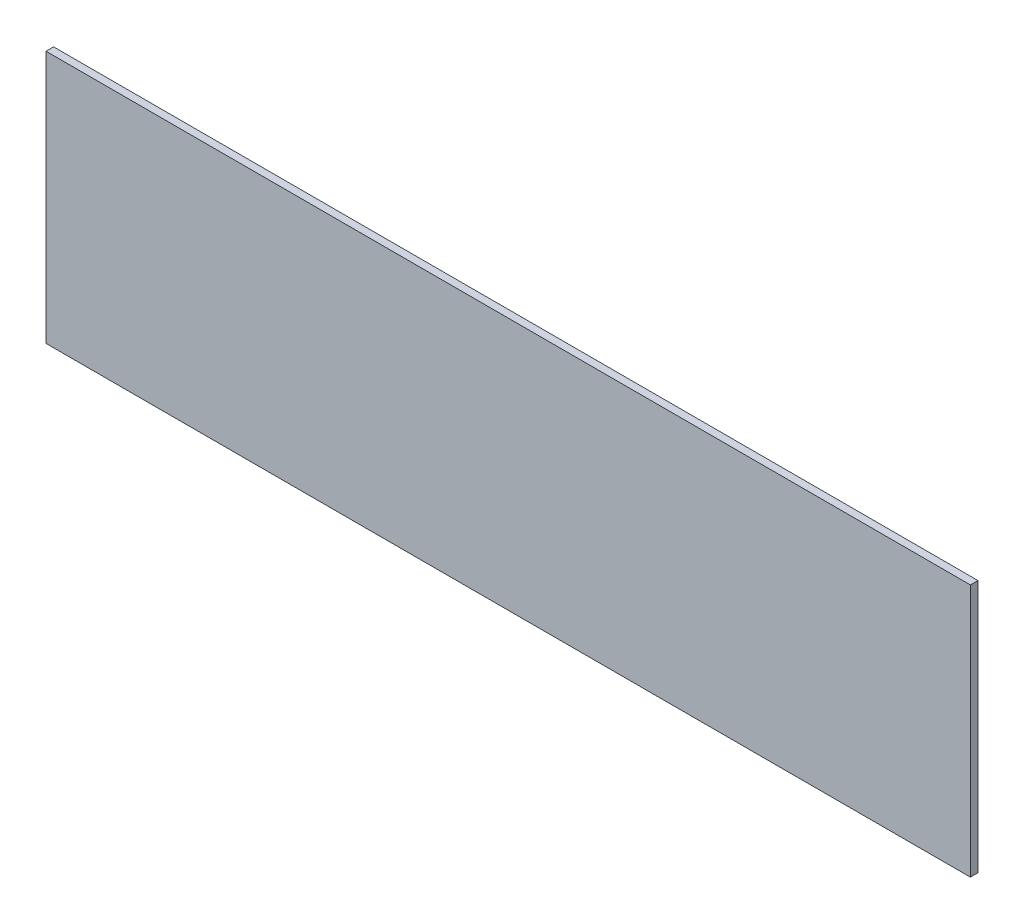
ISO-10303-21;
HEADER;
FILE_DESCRIPTION(('STEP AP214'),'2;1');
FILE_NAME('part.step','',(''),(''),'','','');
FILE_SCHEMA(('AUTOMOTIVE_DESIGN { 1 0 10303 214 1 1 1 1 }'));
ENDSEC;
DATA;
#1=APPLICATION_CONTEXT('core data for automotive mechanical design processes');
#2=APPLICATION_PROTOCOL_DEFINITION('international standard','automotive_design',2000,#1);
#3=PRODUCT_CONTEXT('',#1,'mechanical');
#4=PRODUCT('Part','Part','',(#3));
#5=PRODUCT_RELATED_PRODUCT_CATEGORY('part','',(#4));
#6=PRODUCT_DEFINITION_FORMATION('','',#4);
#7=PRODUCT_DEFINITION_CONTEXT('part definition',#1,'design');
#8=PRODUCT_DEFINITION('design','',#6,#7);
#9=PRODUCT_DEFINITION_SHAPE('','',#8);
#10=(LENGTH_UNIT() NAMED_UNIT(*) SI_UNIT(.MILLI.,.METRE.));
#11=(NAMED_UNIT(*) PLANE_ANGLE_UNIT() SI_UNIT($,.RADIAN.));
#12=(NAMED_UNIT(*) SI_UNIT($,.STERADIAN.) SOLID_ANGLE_UNIT());
#13=UNCERTAINTY_MEASURE_WITH_UNIT(LENGTH_MEASURE(1.E-05),#10,'distance_accuracy_value','');
#14=(GEOMETRIC_REPRESENTATION_CONTEXT(3) GLOBAL_UNCERTAINTY_ASSIGNED_CONTEXT((#13)) GLOBAL_UNIT_ASSIGNED_CONTEXT((#10,
#11,#12)) REPRESENTATION_CONTEXT('',''));
#15=CARTESIAN_POINT('',(0.,0.,0.));
#16=DIRECTION('',(0.,0.,1.));
#17=DIRECTION('',(1.,0.,0.));
#18=AXIS2_PLACEMENT_3D('',#15,#16,#17);
#19=CARTESIAN_POINT('',(-193.675,53.0225,3.175));
#20=DIRECTION('',(1.,0.,0.));
#21=DIRECTION('',(0.,0.,-1.));
#22=AXIS2_PLACEMENT_3D('',#19,#20,#21);
#23=PLANE('',#22);
#24=DIRECTION('',(0.,-1.,0.));
#25=VECTOR('',#24,1.);
#26=CARTESIAN_POINT('',(-193.675,53.0225,0.));
#27=LINE('',#26,#25);
#28=CARTESIAN_POINT('',(-193.675,53.0225,0.));
#29=VERTEX_POINT('',#28);
#30=CARTESIAN_POINT('',(-193.675,-53.0225,0.));
#31=VERTEX_POINT('',#30);
#32=EDGE_CURVE('E95',#29,#31,#27,.T.);
#33=ORIENTED_EDGE('',*,*,#32,.T.);
#34=DIRECTION('',(0.,0.,-1.));
#35=VECTOR('',#34,1.);
#36=CARTESIAN_POINT('',(-193.675,-53.0225,3.175));
#37=LINE('',#36,#35);
#38=CARTESIAN_POINT('',(-193.675,-53.0225,3.175));
#39=VERTEX_POINT('',#38);
#40=EDGE_CURVE('E11',#39,#31,#37,.T.);
#41=ORIENTED_EDGE('',*,*,#40,.F.);
#42=DIRECTION('',(0.,-1.,0.));
#43=VECTOR('',#42,1.);
#44=CARTESIAN_POINT('',(-193.675,53.0225,3.175));
#45=LINE('',#44,#43);
#46=CARTESIAN_POINT('',(-193.675,53.0225,3.175));
#47=VERTEX_POINT('',#46);
#48=EDGE_CURVE('E83',#47,#39,#45,.T.);
#49=ORIENTED_EDGE('',*,*,#48,.F.);
#50=DIRECTION('',(0.,0.,-1.));
#51=VECTOR('',#50,1.);
#52=CARTESIAN_POINT('',(-193.675,53.0225,3.175));
#53=LINE('',#52,#51);
#54=EDGE_CURVE('E91',#47,#29,#53,.T.);
#55=ORIENTED_EDGE('',*,*,#54,.T.);
#56=EDGE_LOOP('',(#33,#41,#49,#55));
#57=FACE_BOUND('',#56,.T.);
#58=ADVANCED_FACE('F32',(#57),#23,.F.);
#59=CARTESIAN_POINT('',(-193.675,-53.0225,3.175));
#60=DIRECTION('',(0.,1.,0.));
#61=DIRECTION('',(-1.,0.,0.));
#62=AXIS2_PLACEMENT_3D('',#59,#60,#61);
#63=PLANE('',#62);
#64=DIRECTION('',(1.,0.,0.));
#65=VECTOR('',#64,1.);
#66=CARTESIAN_POINT('',(-193.675,-53.0225,0.));
#67=LINE('',#66,#65);
#68=CARTESIAN_POINT('',(193.675,-53.0225,0.));
#69=VERTEX_POINT('',#68);
#70=EDGE_CURVE('E87',#31,#69,#67,.T.);
#71=ORIENTED_EDGE('',*,*,#70,.T.);
#72=DIRECTION('',(0.,0.,-1.));
#73=VECTOR('',#72,1.);
#74=CARTESIAN_POINT('',(193.675,-53.0225,3.175));
#75=LINE('',#74,#73);
#76=CARTESIAN_POINT('',(193.675,-53.0225,3.175));
#77=VERTEX_POINT('',#76);
#78=EDGE_CURVE('E40',#77,#69,#75,.T.);
#79=ORIENTED_EDGE('',*,*,#78,.F.);
#80=DIRECTION('',(1.,0.,0.));
#81=VECTOR('',#80,1.);
#82=CARTESIAN_POINT('',(-193.675,-53.0225,3.175));
#83=LINE('',#82,#81);
#84=EDGE_CURVE('E78',#39,#77,#83,.T.);
#85=ORIENTED_EDGE('',*,*,#84,.F.);
#86=ORIENTED_EDGE('',*,*,#40,.T.);
#87=EDGE_LOOP('',(#71,#79,#85,#86));
#88=FACE_BOUND('',#87,.T.);
#89=ADVANCED_FACE('F86',(#88),#63,.F.);
#90=CARTESIAN_POINT('',(193.675,53.0225,3.175));
#91=DIRECTION('',(-1.,0.,0.));
#92=DIRECTION('',(0.,0.,1.));
#93=AXIS2_PLACEMENT_3D('',#90,#91,#92);
#94=PLANE('',#93);
#95=DIRECTION('',(0.,1.,0.));
#96=VECTOR('',#95,1.);
#97=CARTESIAN_POINT('',(193.675,53.0225,0.));
#98=LINE('',#97,#96);
#99=CARTESIAN_POINT('',(193.675,53.0225,0.));
#100=VERTEX_POINT('',#99);
#101=EDGE_CURVE('E65',#69,#100,#98,.T.);
#102=ORIENTED_EDGE('',*,*,#101,.T.);
#103=DIRECTION('',(0.,0.,-1.));
#104=VECTOR('',#103,1.);
#105=CARTESIAN_POINT('',(193.675,53.0225,3.175));
#106=LINE('',#105,#104);
#107=CARTESIAN_POINT('',(193.675,53.0225,3.175));
#108=VERTEX_POINT('',#107);
#109=EDGE_CURVE('E88',#108,#100,#106,.T.);
#110=ORIENTED_EDGE('',*,*,#109,.F.);
#111=DIRECTION('',(0.,1.,0.));
#112=VECTOR('',#111,1.);
#113=CARTESIAN_POINT('',(193.675,53.0225,3.175));
#114=LINE('',#113,#112);
#115=EDGE_CURVE('E81',#77,#108,#114,.T.);
#116=ORIENTED_EDGE('',*,*,#115,.F.);
#117=ORIENTED_EDGE('',*,*,#78,.T.);
#118=EDGE_LOOP('',(#102,#110,#116,#117));
#119=FACE_BOUND('',#118,.T.);
#120=ADVANCED_FACE('F89',(#119),#94,.F.);
#121=CARTESIAN_POINT('',(-193.675,53.0225,3.175));
#122=DIRECTION('',(0.,-1.,0.));
#123=DIRECTION('',(0.,0.,-1.));
#124=AXIS2_PLACEMENT_3D('',#121,#122,#123);
#125=PLANE('',#124);
#126=DIRECTION('',(-1.,0.,0.));
#127=VECTOR('',#126,1.);
#128=CARTESIAN_POINT('',(-193.675,53.0225,0.));
#129=LINE('',#128,#127);
#130=EDGE_CURVE('E71',#100,#29,#129,.T.);
#131=ORIENTED_EDGE('',*,*,#130,.T.);
#132=ORIENTED_EDGE('',*,*,#54,.F.);
#133=DIRECTION('',(-1.,0.,0.));
#134=VECTOR('',#133,1.);
#135=CARTESIAN_POINT('',(-193.675,53.0225,3.175));
#136=LINE('',#135,#134);
#137=EDGE_CURVE('E48',#108,#47,#136,.T.);
#138=ORIENTED_EDGE('',*,*,#137,.F.);
#139=ORIENTED_EDGE('',*,*,#109,.T.);
#140=EDGE_LOOP('',(#131,#132,#138,#139));
#141=FACE_BOUND('',#140,.T.);
#142=ADVANCED_FACE('F102',(#141),#125,.F.);
#143=CARTESIAN_POINT('',(0.,0.,3.175));
#144=DIRECTION('',(0.,0.,1.));
#145=DIRECTION('',(1.,0.,0.));
#146=AXIS2_PLACEMENT_3D('',#143,#144,#145);
#147=PLANE('',#146);
#148=ORIENTED_EDGE('',*,*,#48,.T.);
#149=ORIENTED_EDGE('',*,*,#84,.T.);
#150=ORIENTED_EDGE('',*,*,#115,.T.);
#151=ORIENTED_EDGE('',*,*,#137,.T.);
#152=EDGE_LOOP('',(#148,#149,#150,#151));
#153=FACE_BOUND('',#152,.T.);
#154=ADVANCED_FACE('F79',(#153),#147,.T.);
#155=CARTESIAN_POINT('',(0.,0.,0.));
#156=DIRECTION('',(0.,0.,1.));
#157=DIRECTION('',(1.,0.,0.));
#158=AXIS2_PLACEMENT_3D('',#155,#156,#157);
#159=PLANE('',#158);
#160=ORIENTED_EDGE('',*,*,#32,.F.);
#161=ORIENTED_EDGE('',*,*,#130,.F.);
#162=ORIENTED_EDGE('',*,*,#101,.F.);
#163=ORIENTED_EDGE('',*,*,#70,.F.);
#164=EDGE_LOOP('',(#160,#161,#162,#163));
#165=FACE_BOUND('',#164,.T.);
#166=ADVANCED_FACE('F105',(#165),#159,.F.);
#167=CLOSED_SHELL('',(#58,#89,#120,#142,#154,#166));
#168=MANIFOLD_SOLID_BREP('B2',#167);
#169=ADVANCED_BREP_SHAPE_REPRESENTATION('',(#18,#168),#14);
#170=SHAPE_DEFINITION_REPRESENTATION(#9,#169);
ENDSEC;
END-ISO-10303-21;
